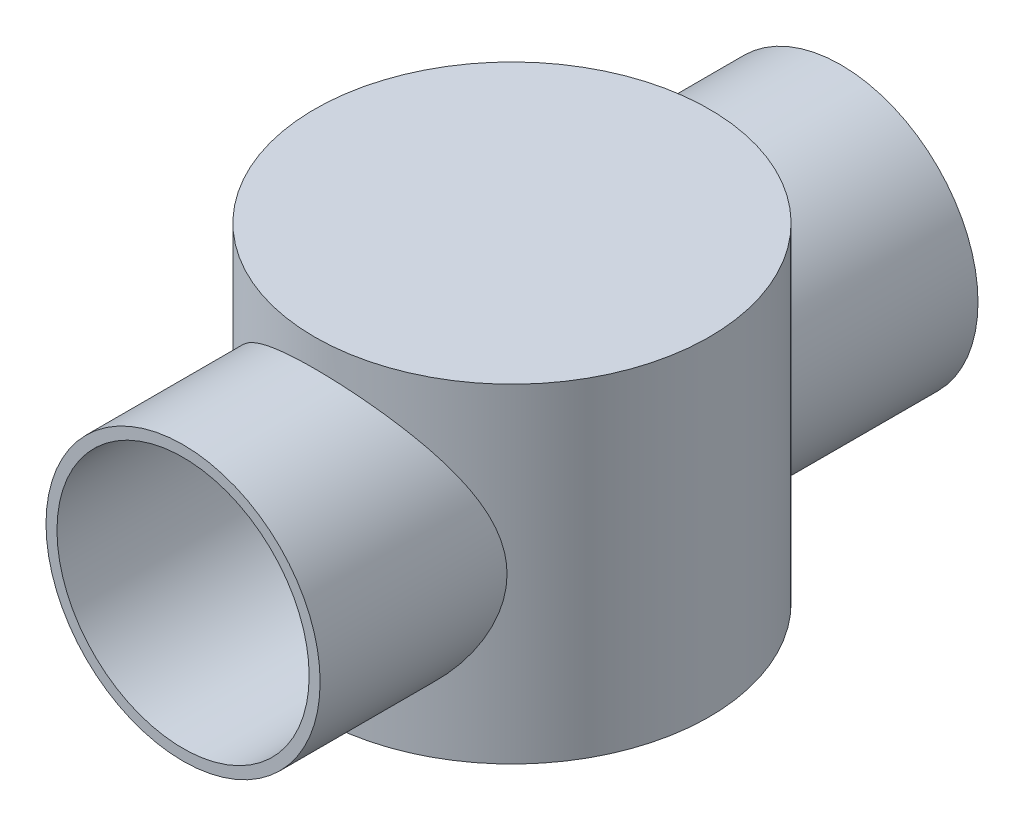
ISO-10303-21;
HEADER;
FILE_DESCRIPTION(('STEP AP214'),'2;1');
FILE_NAME('part.step','',(''),(''),'','','');
FILE_SCHEMA(('AUTOMOTIVE_DESIGN { 1 0 10303 214 1 1 1 1 }'));
ENDSEC;
DATA;
#1=APPLICATION_CONTEXT('core data for automotive mechanical design processes');
#2=APPLICATION_PROTOCOL_DEFINITION('international standard','automotive_design',2000,#1);
#3=PRODUCT_CONTEXT('',#1,'mechanical');
#4=PRODUCT('Part','Part','',(#3));
#5=PRODUCT_RELATED_PRODUCT_CATEGORY('part','',(#4));
#6=PRODUCT_DEFINITION_FORMATION('','',#4);
#7=PRODUCT_DEFINITION_CONTEXT('part definition',#1,'design');
#8=PRODUCT_DEFINITION('design','',#6,#7);
#9=PRODUCT_DEFINITION_SHAPE('','',#8);
#10=(LENGTH_UNIT() NAMED_UNIT(*) SI_UNIT(.MILLI.,.METRE.));
#11=(NAMED_UNIT(*) PLANE_ANGLE_UNIT() SI_UNIT($,.RADIAN.));
#12=(NAMED_UNIT(*) SI_UNIT($,.STERADIAN.) SOLID_ANGLE_UNIT());
#13=UNCERTAINTY_MEASURE_WITH_UNIT(LENGTH_MEASURE(1.E-05),#10,'distance_accuracy_value','');
#14=(GEOMETRIC_REPRESENTATION_CONTEXT(3) GLOBAL_UNCERTAINTY_ASSIGNED_CONTEXT((#13)) GLOBAL_UNIT_ASSIGNED_CONTEXT((#10,
#11,#12)) REPRESENTATION_CONTEXT('',''));
#15=CARTESIAN_POINT('',(0.,0.,0.));
#16=DIRECTION('',(0.,0.,1.));
#17=DIRECTION('',(1.,0.,0.));
#18=AXIS2_PLACEMENT_3D('',#15,#16,#17);
#19=CARTESIAN_POINT('',(0.,30.,0.));
#20=DIRECTION('',(0.,-1.,0.));
#21=DIRECTION('',(0.,0.,-1.));
#22=AXIS2_PLACEMENT_3D('',#19,#20,#21);
#23=CYLINDRICAL_SURFACE('',#22,18.);
#24=CARTESIAN_POINT('',(0.,27.5,-18.));
#25=CARTESIAN_POINT('',(-0.311320399920425,27.5000007881177,-18.000000731677));
#26=CARTESIAN_POINT('',(-0.622631306435012,27.4883541807867,-17.9919068310897));
#27=CARTESIAN_POINT('',(-1.24267850062256,27.4419610864565,-17.9597359592503));
#28=CARTESIAN_POINT('',(-1.55141489222856,27.4072155365763,-17.9356596364017));
#29=CARTESIAN_POINT('',(-2.16398026841423,27.3151597306378,-17.872102635107));
#30=CARTESIAN_POINT('',(-2.46780765796138,27.2578422881339,-17.832617050692));
#31=CARTESIAN_POINT('',(-3.06826221688685,27.1214917950907,-17.7391685432545));
#32=CARTESIAN_POINT('',(-3.3648892162219,27.042458232249,-17.6852052786915));
#33=CARTESIAN_POINT('',(-3.94759562422336,26.8641845184547,-17.5642992210941));
#34=CARTESIAN_POINT('',(-4.23371994775082,26.7650462505048,-17.4974219499454));
#35=CARTESIAN_POINT('',(-4.79541984254895,26.5474961815674,-17.351891309388));
#36=CARTESIAN_POINT('',(-5.07099549402368,26.4290845271559,-17.2732380295375));
#37=CARTESIAN_POINT('',(-5.61033962013419,26.1742134665027,-17.1056665513965));
#38=CARTESIAN_POINT('',(-5.87411006845259,26.037757092313,-17.0167500779476));
#39=CARTESIAN_POINT('',(-6.38905217616275,25.7478999274759,-16.8301826011411));
#40=CARTESIAN_POINT('',(-6.64021910860794,25.5944928475245,-16.7325283583395));
#41=CARTESIAN_POINT('',(-7.15057236632087,25.2577187619915,-16.5212624964768));
#42=CARTESIAN_POINT('',(-7.40853486712312,25.0729045679924,-16.407002352266));
#43=CARTESIAN_POINT('',(-7.90793178514215,24.6857859071178,-16.17222184494));
#44=CARTESIAN_POINT('',(-8.14936566458043,24.4834808716408,-16.0517012783586));
#45=CARTESIAN_POINT('',(-8.61553858934382,24.0620842476447,-15.8063900878489));
#46=CARTESIAN_POINT('',(-8.84025167771147,23.8429675896295,-15.6815932467326));
#47=CARTESIAN_POINT('',(-9.27206071755608,23.389099602017,-15.4302074034379));
#48=CARTESIAN_POINT('',(-9.47916034452515,23.1543515526223,-15.3036187816224));
#49=CARTESIAN_POINT('',(-9.90967313478784,22.627792855491,-15.0291157120774));
#50=CARTESIAN_POINT('',(-10.1296948943652,22.3331428695244,-14.8813068083426));
#51=CARTESIAN_POINT('',(-10.5440092675764,21.7238111474815,-14.5906791488182));
#52=CARTESIAN_POINT('',(-10.738295342259,21.4091243503883,-14.4478616680145));
#53=CARTESIAN_POINT('',(-11.0995515347588,20.7608569146594,-14.172208979582));
#54=CARTESIAN_POINT('',(-11.2665573185518,20.427301725525,-14.0393608630349));
#55=CARTESIAN_POINT('',(-11.5717530284827,19.7418467457873,-13.7888906177999));
#56=CARTESIAN_POINT('',(-11.709957929013,19.3899566076102,-13.671260588923));
#57=CARTESIAN_POINT('',(-11.9175777008529,18.7803111433832,-13.4901468569229));
#58=CARTESIAN_POINT('',(-11.9950717632579,18.5269249889904,-13.4211421027558));
#59=CARTESIAN_POINT('',(-12.134373842049,18.0129415849358,-13.2953294979551));
#60=CARTESIAN_POINT('',(-12.1961864748637,17.7523464826162,-13.238518058513));
#61=CARTESIAN_POINT('',(-12.3032187525588,17.2255188949047,-13.1391077531212));
#62=CARTESIAN_POINT('',(-12.3484644980007,16.9592959820817,-13.0964865406526));
#63=CARTESIAN_POINT('',(-12.4217580013532,16.4224309928378,-13.0269909720634));
#64=CARTESIAN_POINT('',(-12.4498057740043,16.1517889202049,-13.0001166024461));
#65=CARTESIAN_POINT('',(-12.4882797677908,15.6065886416308,-12.9631630375502));
#66=CARTESIAN_POINT('',(-12.4986079433365,15.3320170693527,-12.9531772942498));
#67=CARTESIAN_POINT('',(-12.5011287971122,14.7827126489487,-12.9507444739345));
#68=CARTESIAN_POINT('',(-12.4933215177135,14.507979801201,-12.9582973559426));
#69=CARTESIAN_POINT('',(-12.459722240521,13.9604826584172,-12.9906064202795));
#70=CARTESIAN_POINT('',(-12.4339193210035,13.6877196605265,-13.0153730497628));
#71=CARTESIAN_POINT('',(-12.3648157292816,13.1464092260284,-13.0810393461224));
#72=CARTESIAN_POINT('',(-12.3215146821552,12.8778618798755,-13.1219393586786));
#73=CARTESIAN_POINT('',(-12.2213830333495,12.3633087709337,-13.2152243963537));
#74=CARTESIAN_POINT('',(-12.1655678897363,12.1169435895205,-13.2667312149682));
#75=CARTESIAN_POINT('',(-12.0398975180506,11.6304214111863,-13.3808848961772));
#76=CARTESIAN_POINT('',(-11.9700371133261,11.3902667402102,-13.4435358651791));
#77=CARTESIAN_POINT('',(-11.7403809760295,10.6801807288625,-13.6456942318489));
#78=CARTESIAN_POINT('',(-11.560503590979,10.2205935242823,-13.7994136375129));
#79=CARTESIAN_POINT('',(-11.2015564207548,9.4400543955594,-14.0913121414945));
#80=CARTESIAN_POINT('',(-11.0326655226633,9.11231351521577,-14.2243586578052));
#81=CARTESIAN_POINT('',(-10.6684902470393,8.4756021232813,-14.4994962063504));
#82=CARTESIAN_POINT('',(-10.4731953769698,8.16663914485582,-14.6415908222261));
#83=CARTESIAN_POINT('',(-10.0571360107904,7.56782568543127,-14.93044822444));
#84=CARTESIAN_POINT('',(-9.83632737157997,7.27800973549363,-15.0772187734031));
#85=CARTESIAN_POINT('',(-9.37043152105822,6.71885267060023,-15.3711048725789));
#86=CARTESIAN_POINT('',(-9.12534734432854,6.44950900391229,-15.5182203774311));
#87=CARTESIAN_POINT('',(-8.60878316596403,5.92946290388744,-15.810690004262));
#88=CARTESIAN_POINT('',(-8.33704228658089,5.67899832394039,-15.9560069074782));
#89=CARTESIAN_POINT('',(-7.77021056973397,5.201472251432,-16.2395891488841));
#90=CARTESIAN_POINT('',(-7.47511759556365,4.97441290482628,-16.3778538398915));
#91=CARTESIAN_POINT('',(-6.86313112879639,4.54597225366917,-16.6435728993947));
#92=CARTESIAN_POINT('',(-6.5462778241747,4.3445454741652,-16.7710462744071));
#93=CARTESIAN_POINT('',(-5.89171270058505,3.96913644818394,-17.0120322082357));
#94=CARTESIAN_POINT('',(-5.55400717646866,3.79514597507712,-17.1255489496161));
#95=CARTESIAN_POINT('',(-4.93667435087042,3.5122838774699,-17.3121052009347));
#96=CARTESIAN_POINT('',(-4.66075600112096,3.39752540461204,-17.3885405284797));
#97=CARTESIAN_POINT('',(-4.09874523522462,3.18728426716007,-17.5295226782729));
#98=CARTESIAN_POINT('',(-3.81265487051392,3.09179774154977,-17.5940718816054));
#99=CARTESIAN_POINT('',(-3.23196491189394,2.92126139127021,-17.7099410942229));
#100=CARTESIAN_POINT('',(-2.93736940056444,2.84620193598668,-17.7612673370375));
#101=CARTESIAN_POINT('',(-2.34140857486937,2.71746235086375,-17.849608853893));
#102=CARTESIAN_POINT('',(-2.04004311844967,2.66378267008075,-17.8866238273423));
#103=CARTESIAN_POINT('',(-1.4315283198651,2.5784267757545,-17.9455990048085));
#104=CARTESIAN_POINT('',(-1.12436097402841,2.54683739015424,-17.9674997967678));
#105=CARTESIAN_POINT('',(-0.507806023379982,2.50649888716343,-17.9954815992818));
#106=CARTESIAN_POINT('',(-0.198418419359331,2.49774976163511,-18.0015626154731));
#107=CARTESIAN_POINT('',(0.420050756882506,2.50323267552499,-17.9977551434437));
#108=CARTESIAN_POINT('',(0.729132330636854,2.51746459922299,-17.9878667356366));
#109=CARTESIAN_POINT('',(1.34447957565647,2.56868114932978,-17.9523632811902));
#110=CARTESIAN_POINT('',(1.65074533809179,2.60566503642604,-17.9267487455629));
#111=CARTESIAN_POINT('',(2.23927541240118,2.69882731708707,-17.8624687967111));
#112=CARTESIAN_POINT('',(2.52185162333256,2.75367535091744,-17.8247097270596));
#113=CARTESIAN_POINT('',(3.0806783153945,2.88217766451085,-17.7366690185098));
#114=CARTESIAN_POINT('',(3.35692911270888,2.95583100202091,-17.6863880070353));
#115=CARTESIAN_POINT('',(3.90156410766982,3.12107814043559,-17.5742738724126));
#116=CARTESIAN_POINT('',(4.16994889761655,3.2126705865379,-17.5124416216564));
#117=CARTESIAN_POINT('',(4.69769215509028,3.41287878505748,-17.3783156384069));
#118=CARTESIAN_POINT('',(4.95704725604193,3.52150080535138,-17.3060180548151));
#119=CARTESIAN_POINT('',(5.48423252849856,3.76330392165646,-17.1465588362983));
#120=CARTESIAN_POINT('',(5.75129246214408,3.89770099080385,-17.0586964063433));
#121=CARTESIAN_POINT('',(6.27282216592668,4.18379843456298,-16.87389364273));
#122=CARTESIAN_POINT('',(6.52728660120513,4.33550605269518,-16.776949511935));
#123=CARTESIAN_POINT('',(7.0228417481772,4.65511457222595,-16.5756219290891));
#124=CARTESIAN_POINT('',(7.26392848537503,4.8230202458981,-16.4712362869982));
#125=CARTESIAN_POINT('',(7.7321050957996,5.17400555434002,-16.2567177712083));
#126=CARTESIAN_POINT('',(7.959193347751,5.35708694099328,-16.1465842345178));
#127=CARTESIAN_POINT('',(8.43636798345726,5.76996890826061,-15.9031790708217));
#128=CARTESIAN_POINT('',(8.68378752169934,6.00241677450386,-15.769160440539));
#129=CARTESIAN_POINT('',(9.15825747915977,6.48583202251305,-15.4984174988106));
#130=CARTESIAN_POINT('',(9.38530489429072,6.7368021256689,-15.3616927919413));
#131=CARTESIAN_POINT('',(9.81855806068082,7.25658525117956,-15.0884574150436));
#132=CARTESIAN_POINT('',(10.0247492483396,7.52541052748361,-14.95194695922));
#133=CARTESIAN_POINT('',(10.4153760936451,8.08010177730584,-14.6825139944411));
#134=CARTESIAN_POINT('',(10.5998145028604,8.36596558867169,-14.5495910333378));
#135=CARTESIAN_POINT('',(10.9270965024338,8.9220914466448,-14.305090664831));
#136=CARTESIAN_POINT('',(11.0722829221891,9.19064706505239,-14.1927675977497));
#137=CARTESIAN_POINT('',(11.3437968982352,9.74050631550314,-13.9767081782071));
#138=CARTESIAN_POINT('',(11.4701242259695,10.0218101019897,-13.8729719298177));
#139=CARTESIAN_POINT('',(11.7026245208659,10.596094408124,-13.6774131044558));
#140=CARTESIAN_POINT('',(11.8088296103176,10.8890553982851,-13.5855716146506));
#141=CARTESIAN_POINT('',(12.0000146690085,11.4860554800293,-13.4170011159792));
#142=CARTESIAN_POINT('',(12.0849999433626,11.7900917808755,-13.3402683308386));
#143=CARTESIAN_POINT('',(12.2182478508252,12.3485238407824,-13.2182051251944));
#144=CARTESIAN_POINT('',(12.2704254511073,12.6012890898089,-13.1696755115163));
#145=CARTESIAN_POINT('',(12.3592702105864,13.1117432606945,-13.0863350699331));
#146=CARTESIAN_POINT('',(12.3959407456396,13.3694310981363,-13.0515212562395));
#147=CARTESIAN_POINT('',(12.4531630584138,13.8879350928535,-12.9969343623921));
#148=CARTESIAN_POINT('',(12.4737302454128,14.1487480164394,-12.9771469040807));
#149=CARTESIAN_POINT('',(12.4984360228864,14.6718827163967,-12.9533546705078));
#150=CARTESIAN_POINT('',(12.5025744011595,14.9342045122137,-12.9493500991048));
#151=CARTESIAN_POINT('',(12.4943408363494,15.458515031979,-12.9572943884832));
#152=CARTESIAN_POINT('',(12.4819580945241,15.720503425931,-12.9692536837703));
#153=CARTESIAN_POINT('',(12.440893901037,16.2420073147799,-13.0086493963747));
#154=CARTESIAN_POINT('',(12.412212546458,16.501522824397,-13.0360857215028));
#155=CARTESIAN_POINT('',(12.3389986266428,17.0166507896635,-13.1054051586568));
#156=CARTESIAN_POINT('',(12.2944472319189,17.272258231127,-13.1473054300332));
#157=CARTESIAN_POINT('',(12.1901619031325,17.7778819175319,-13.2440551928841));
#158=CARTESIAN_POINT('',(12.1304243539571,18.0278968157102,-13.2989077674745));
#159=CARTESIAN_POINT('',(11.9768092653866,18.5938043870992,-13.4376213550251));
#160=CARTESIAN_POINT('',(11.8780580771438,18.9074520883862,-13.5252695016876));
#161=CARTESIAN_POINT('',(11.6579478787732,19.5220451500959,-13.7154431106477));
#162=CARTESIAN_POINT('',(11.5365818571558,19.82298653547,-13.8179731847441));
#163=CARTESIAN_POINT('',(11.2724911751495,20.4115719579404,-14.0342473268634));
#164=CARTESIAN_POINT('',(11.1297415987181,20.6991999636696,-14.1480044231101));
#165=CARTESIAN_POINT('',(10.8241270591563,21.2602168679723,-14.3831653910737));
#166=CARTESIAN_POINT('',(10.6612633353483,21.5336066423525,-14.5045687914421));
#167=CARTESIAN_POINT('',(10.3123343939813,22.0718426624964,-14.7547582990502));
#168=CARTESIAN_POINT('',(10.1258240657712,22.336350957248,-14.8836497126861));
#169=CARTESIAN_POINT('',(9.7333642472688,22.8495846263023,-15.1432155840668));
#170=CARTESIAN_POINT('',(9.52741480464069,23.0983100393017,-15.2738900374389));
#171=CARTESIAN_POINT('',(9.09656663348192,23.5794390712763,-15.5343445013484));
#172=CARTESIAN_POINT('',(8.87166225858612,23.8118377887255,-15.6641242328196));
#173=CARTESIAN_POINT('',(8.40345080276108,24.2594230615636,-15.9202147459001));
#174=CARTESIAN_POINT('',(8.16014192681605,24.4746079338408,-16.046525187503));
#175=CARTESIAN_POINT('',(7.61332624290886,24.9212854382121,-16.3139431002473));
#176=CARTESIAN_POINT('',(7.3065669432611,25.1494610303998,-16.453979696678));
#177=CARTESIAN_POINT('',(6.66975124855428,25.5788415966015,-16.722254715961));
#178=CARTESIAN_POINT('',(6.33969127170836,25.780042410203,-16.8504913179052));
#179=CARTESIAN_POINT('',(5.65828495469929,26.1527769868363,-17.0913496260948));
#180=CARTESIAN_POINT('',(5.3069628140265,26.3243436512688,-17.2039886217031));
#181=CARTESIAN_POINT('',(4.58507299306316,26.6353520713999,-17.4102805123675));
#182=CARTESIAN_POINT('',(4.21451184563756,26.7748046455683,-17.503939799954));
#183=CARTESIAN_POINT('',(3.53078207948951,26.9952677136963,-17.6530797369256));
#184=CARTESIAN_POINT('',(3.22041077517135,27.0823667780218,-17.712441759367));
#185=CARTESIAN_POINT('',(2.59137372701929,27.2327141577823,-17.8153383699576));
#186=CARTESIAN_POINT('',(2.27270914343893,27.2959657905689,-17.858875159482));
#187=CARTESIAN_POINT('',(1.62985419119081,27.3975556176929,-17.9289719343013));
#188=CARTESIAN_POINT('',(1.3056686473665,27.435914524093,-17.9555460331483));
#189=CARTESIAN_POINT('',(0.654318536286639,27.4871360564587,-17.9910595123127));
#190=CARTESIAN_POINT('',(0.327154026331433,27.499999171799,-17.9999992311102));
#191=CARTESIAN_POINT('',(0.,27.5,-18.));
#192=B_SPLINE_CURVE_WITH_KNOTS('',3,(#24,#25,#26,#27,#28,#29,#30,#31,#32,#33,#34,#35,#36,#37,
#38,#39,#40,#41,#42,#43,#44,#45,#46,#47,#48,#49,#50,#51,#52,#53,#54,#55,#56,#57,#58,#59,#60,#61,
#62,#63,#64,#65,#66,#67,#68,#69,#70,#71,#72,#73,#74,#75,#76,#77,#78,#79,#80,#81,#82,#83,#84,#85,
#86,#87,#88,#89,#90,#91,#92,#93,#94,#95,#96,#97,#98,#99,#100,#101,#102,#103,#104,#105,#106,#107,
#108,#109,#110,#111,#112,#113,#114,#115,#116,#117,#118,#119,#120,#121,#122,#123,#124,#125,#126,
#127,#128,#129,#130,#131,#132,#133,#134,#135,#136,#137,#138,#139,#140,#141,#142,#143,#144,#145,
#146,#147,#148,#149,#150,#151,#152,#153,#154,#155,#156,#157,#158,#159,#160,#161,#162,#163,#164,
#165,#166,#167,#168,#169,#170,#171,#172,#173,#174,#175,#176,#177,#178,#179,#180,#181,#182,#183,
#184,#185,#186,#187,#188,#189,#190,#191),.UNSPECIFIED.,.T.,.F.,(4,2,2,2,2,2,2,2,2,2,2,2,2,2,2,2,
2,2,2,2,2,2,2,2,2,2,2,2,2,2,2,2,2,2,2,2,2,2,2,2,2,2,2,2,2,2,2,2,2,2,2,2,2,2,2,2,2,2,2,2,2,2,2,2,
2,2,2,2,2,2,2,2,2,2,2,2,2,2,2,2,2,2,2,4),(0.,0.933624947814568,1.86721202097863,
2.80109657048012,3.73500315303643,4.66429028538479,5.59357035073977,6.52269446721874,
7.45216448621777,8.46302839743877,9.47392518271222,10.4863598651547,11.4985827565715,
12.6862008655619,13.8741201494284,15.0604737094207,16.2462089032293,17.0669215736163,
17.8873923547393,18.7065648931763,19.5257367294933,20.3494267395149,21.1731148250854,
21.9973032502429,22.8215093357315,23.5941713808879,24.3671187293383,25.9129089294303,
27.0874967653771,28.2625527441588,29.4396730996352,30.6166464935651,31.8065766183639,
32.9966157474236,34.1845132775931,35.3720539429724,36.2964935720594,37.2207478111027,
38.144565540299,39.068402672151,39.9958509246877,40.9232988467833,41.8507420987645,
42.7781552155799,43.6481414893545,44.5180841804054,45.3879611967204,46.2581591334188,
47.192082876349,48.1263988585481,49.0609909546482,49.9956910906679,51.0895258221994,
52.1835215871804,53.2782760749245,54.3728919353043,55.3479449453504,56.3230097712754,
57.2965046824979,58.2697559683629,59.0568195040135,59.8437116092359,60.6298498147753,
61.4159981743777,62.20266063797,62.9893184158477,63.7769126734933,64.564694596348,
65.5841111046669,66.6038441997531,67.6247748619828,68.6456426514725,69.6898367085289,
70.73402820532,71.7785318566167,72.8231375114393,74.0429262395139,75.262902883883,
76.4815162155208,77.6997184229364,78.6818007276419,79.6637463670817,80.6448739247576,
81.6259826501707),.UNSPECIFIED.);
#193=CARTESIAN_POINT('',(0.,27.5,-18.));
#194=VERTEX_POINT('',#193);
#195=EDGE_CURVE('E45',#194,#194,#192,.T.);
#196=ORIENTED_EDGE('',*,*,#195,.T.);
#197=EDGE_LOOP('',(#196));
#198=FACE_BOUND('',#197,.T.);
#199=CARTESIAN_POINT('',(12.5,15.,12.9518338469886));
#200=CARTESIAN_POINT('',(12.4999976797193,14.699104822188,12.9518380580316));
#201=CARTESIAN_POINT('',(12.4891107062001,14.3981777459185,12.9623703478934));
#202=CARTESIAN_POINT('',(12.4458226770992,13.7992970290588,13.0039366124756));
#203=CARTESIAN_POINT('',(12.4134180340691,13.5013438926961,13.0349740058242));
#204=CARTESIAN_POINT('',(12.3277613016309,12.9106141128189,13.116011539855));
#205=CARTESIAN_POINT('',(12.2744759132078,12.6178465221533,13.1660419651719));
#206=CARTESIAN_POINT('',(12.14806377555,12.0399109507838,13.2827681254356));
#207=CARTESIAN_POINT('',(12.074926326434,11.7547471596741,13.349472845971));
#208=CARTESIAN_POINT('',(11.9108858008914,11.1967900768827,13.4960261990246));
#209=CARTESIAN_POINT('',(11.8201921072103,10.9238936275133,13.5757183218099));
#210=CARTESIAN_POINT('',(11.6216207598421,10.388102602949,13.7460936515553));
#211=CARTESIAN_POINT('',(11.5137444903445,10.125207224202,13.8367759730292));
#212=CARTESIAN_POINT('',(11.1656842659496,9.35228372669715,14.121506422653));
#213=CARTESIAN_POINT('',(10.9009711206559,8.85769160180396,14.328329443242));
#214=CARTESIAN_POINT('',(10.4342119359854,8.10916626798092,14.6687789833506));
#215=CARTESIAN_POINT('',(10.2515578840197,7.84033405481909,14.7972818930296));
#216=CARTESIAN_POINT('',(9.86647448321659,7.31834613656705,15.0567760164433));
#217=CARTESIAN_POINT('',(9.6640436757638,7.06519159002117,15.1877674131391));
#218=CARTESIAN_POINT('',(9.23981964746334,6.5749810378033,15.4495293280734));
#219=CARTESIAN_POINT('',(9.01800458555287,6.33794374081089,15.5802994234218));
#220=CARTESIAN_POINT('',(8.55570623570184,5.88103581687445,15.8388776500339));
#221=CARTESIAN_POINT('',(8.31522168943693,5.66116634904986,15.9666855808923));
#222=CARTESIAN_POINT('',(7.77539612252942,5.20522835616953,16.2372595298217));
#223=CARTESIAN_POINT('',(7.47285161548954,4.97236304087319,16.3790670512296));
#224=CARTESIAN_POINT('',(6.84421514626606,4.533208464207,16.6515490396227));
#225=CARTESIAN_POINT('',(6.51811895685266,4.32692399235452,16.7822214987839));
#226=CARTESIAN_POINT('',(5.84445579044713,3.94367780988839,17.0285274719657));
#227=CARTESIAN_POINT('',(5.49692393494182,3.76666979571199,17.1441846705374));
#228=CARTESIAN_POINT('',(4.7821647020107,3.44429036229083,17.3571245354996));
#229=CARTESIAN_POINT('',(4.41494579885826,3.29890546504427,17.4544150275691));
#230=CARTESIAN_POINT('',(3.76371708196102,3.07651952338444,17.6043911081921));
#231=CARTESIAN_POINT('',(3.48352577531744,2.99161277449439,17.662059675042));
#232=CARTESIAN_POINT('',(2.91570147234552,2.84126305538922,17.7646236393564));
#233=CARTESIAN_POINT('',(2.62807004029075,2.77581602938026,17.8095216983643));
#234=CARTESIAN_POINT('',(2.04731540718361,2.66525950394078,17.8855868037861));
#235=CARTESIAN_POINT('',(1.75419572674545,2.62013740255849,17.9167623582151));
#236=CARTESIAN_POINT('',(1.16430646092767,2.55080009036961,17.9647418602541));
#237=CARTESIAN_POINT('',(0.867536752771681,2.5265855847955,17.9815453230799));
#238=CARTESIAN_POINT('',(0.271993540054801,2.49939849824911,18.0004150323214));
#239=CARTESIAN_POINT('',(-0.0267826860795567,2.4964660180024,18.0024534576531));
#240=CARTESIAN_POINT('',(-0.623506228558426,2.51199292652255,17.9916727899375));
#241=CARTESIAN_POINT('',(-0.921453547998446,2.53045223529512,17.9788537524495));
#242=CARTESIAN_POINT('',(-1.51435284920527,2.58849378339618,17.9386468181875));
#243=CARTESIAN_POINT('',(-1.80930410779212,2.62808100459268,17.9112554853359));
#244=CARTESIAN_POINT('',(-2.39404409837468,2.72781495695998,17.8425116428688));
#245=CARTESIAN_POINT('',(-2.6838328226686,2.78796171880018,17.8011591124269));
#246=CARTESIAN_POINT('',(-3.25014030000358,2.92648695052048,17.7064175726975));
#247=CARTESIAN_POINT('',(-3.52681057804168,3.00444069909257,17.6533097389695));
#248=CARTESIAN_POINT('',(-4.07189958108011,3.1783469552641,17.5356033433843));
#249=CARTESIAN_POINT('',(-4.34031848206724,3.27429907868066,17.4710050267978));
#250=CARTESIAN_POINT('',(-4.86763861549374,3.48320694807238,17.3314880748841));
#251=CARTESIAN_POINT('',(-5.12654066287423,3.59616123388916,17.2565703258443));
#252=CARTESIAN_POINT('',(-5.63393974064637,3.8381111796855,17.0976442846672));
#253=CARTESIAN_POINT('',(-5.88243296373269,3.96711264202801,17.0136327058028));
#254=CARTESIAN_POINT('',(-6.3953639721949,4.25545233003509,16.8280064033705));
#255=CARTESIAN_POINT('',(-6.65846946696387,4.41657011439902,16.7254739989572));
#256=CARTESIAN_POINT('',(-7.1700248402112,4.75621823281929,16.5126478677386));
#257=CARTESIAN_POINT('',(-7.41846834630622,4.93475604980778,16.4023508112729));
#258=CARTESIAN_POINT('',(-7.90021497215849,5.30827197885094,16.1758311739301));
#259=CARTESIAN_POINT('',(-8.13350361733577,5.50326541085375,16.0596031120586));
#260=CARTESIAN_POINT('',(-8.58413950856359,5.90855532605528,15.8233140743437));
#261=CARTESIAN_POINT('',(-8.80149125583206,6.11884745460026,15.7032541946162));
#262=CARTESIAN_POINT('',(-9.25686156757815,6.59246449798952,15.4399264815778));
#263=CARTESIAN_POINT('',(-9.49175961410808,6.85859967949683,15.2963016275034));
#264=CARTESIAN_POINT('',(-9.93836824565562,7.41021691416694,15.0099705181362));
#265=CARTESIAN_POINT('',(-10.1500741634077,7.69570284289872,14.8672644531625));
#266=CARTESIAN_POINT('',(-10.5493541665407,8.28525058414792,14.5866600190946));
#267=CARTESIAN_POINT('',(-10.7369324127249,8.58930918044473,14.4487608240565));
#268=CARTESIAN_POINT('',(-11.0867962679823,9.2154103182733,14.1820768600496));
#269=CARTESIAN_POINT('',(-11.2490894407241,9.53744744247986,14.053289371761));
#270=CARTESIAN_POINT('',(-11.5120812251052,10.121552735917,13.8381269853004));
#271=CARTESIAN_POINT('',(-11.618315055378,10.3800748864121,13.7488686847102));
#272=CARTESIAN_POINT('',(-11.8141266329691,10.9066779268415,13.5809808671025));
#273=CARTESIAN_POINT('',(-11.9037086375049,11.1747563526662,13.5023486348242));
#274=CARTESIAN_POINT('',(-12.0651211377789,11.7192462201814,13.3583140370218));
#275=CARTESIAN_POINT('',(-12.1369782367197,11.9956444663706,13.2928918716962));
#276=CARTESIAN_POINT('',(-12.2620739092141,12.5558461612631,13.1775870507921));
#277=CARTESIAN_POINT('',(-12.3153126932096,12.8396495262279,13.1277042195739));
#278=CARTESIAN_POINT('',(-12.4026381412253,13.4156322994948,13.045238057055));
#279=CARTESIAN_POINT('',(-12.4365309212633,13.7078666861925,13.0128300291544));
#280=CARTESIAN_POINT('',(-12.4836126280017,14.2955248179675,12.9676712278828));
#281=CARTESIAN_POINT('',(-12.4968022008865,14.5909484632126,12.9549198409929));
#282=CARTESIAN_POINT('',(-12.5021676878648,15.182105499988,12.9497419885133));
#283=CARTESIAN_POINT('',(-12.4943478410788,15.4778388169992,12.9573114227432));
#284=CARTESIAN_POINT('',(-12.4578878173898,16.0668086006473,12.9923694186606));
#285=CARTESIAN_POINT('',(-12.4292483882957,16.3600451565815,13.0198572649078));
#286=CARTESIAN_POINT('',(-12.3569279832965,16.9029217891393,13.088484769269));
#287=CARTESIAN_POINT('',(-12.3157401532355,17.1531942710192,13.1273354396596));
#288=CARTESIAN_POINT('',(-12.2187698677807,17.6486614157574,13.2176416537223));
#289=CARTESIAN_POINT('',(-12.1629821585536,17.8938542163221,13.2691017345228));
#290=CARTESIAN_POINT('',(-12.0374713886653,18.3781508970087,13.3830660590144));
#291=CARTESIAN_POINT('',(-11.9677405977213,18.6172513161343,13.445576426935));
#292=CARTESIAN_POINT('',(-11.8150493045519,19.0885195392081,13.5799467773926));
#293=CARTESIAN_POINT('',(-11.7320857481663,19.3206857279934,13.6518089176388));
#294=CARTESIAN_POINT('',(-11.5118891942741,19.8842443506223,13.8385638069959));
#295=CARTESIAN_POINT('',(-11.3674026564686,20.2113585109792,13.9578827768067));
#296=CARTESIAN_POINT('',(-11.053077224143,20.8485728627441,14.2080910557213));
#297=CARTESIAN_POINT('',(-10.8832283320815,21.1586662785561,14.3389849191767));
#298=CARTESIAN_POINT('',(-10.5192370165857,21.7616463061753,14.6081129860002));
#299=CARTESIAN_POINT('',(-10.3250553502878,22.0545039735748,14.7463588342131));
#300=CARTESIAN_POINT('',(-9.91363888577974,22.6218462410074,15.0260319940461));
#301=CARTESIAN_POINT('',(-9.69640671788945,22.8963329315576,15.167458941219));
#302=CARTESIAN_POINT('',(-9.23560919213577,23.4309084460669,15.4524495483785));
#303=CARTESIAN_POINT('',(-8.99164854497931,23.6906599808276,15.5960071402852));
#304=CARTESIAN_POINT('',(-8.48127342350149,24.1894126667389,15.879332379517));
#305=CARTESIAN_POINT('',(-8.21485729446084,24.4284122860651,16.0190997465399));
#306=CARTESIAN_POINT('',(-7.66066950562706,24.8839580775869,16.2913884728026));
#307=CARTESIAN_POINT('',(-7.37292648810238,25.1005334607845,16.4239191497394));
#308=CARTESIAN_POINT('',(-6.77671439553398,25.5098440924593,16.6787644708413));
#309=CARTESIAN_POINT('',(-6.46824941143075,25.7025840253221,16.8010811208318));
#310=CARTESIAN_POINT('',(-5.88456902111879,26.0324460534321,17.013279804711));
#311=CARTESIAN_POINT('',(-5.61230059153505,26.1734936050122,17.1051793846704));
#312=CARTESIAN_POINT('',(-5.05527466805322,26.4363015752517,17.2779972878766));
#313=CARTESIAN_POINT('',(-4.77051945719444,26.5580655010421,17.3589176075471));
#314=CARTESIAN_POINT('',(-4.18994515209828,26.7809592004237,17.5081165942596));
#315=CARTESIAN_POINT('',(-3.89413042416615,26.8820970175172,17.5764001882427));
#316=CARTESIAN_POINT('',(-3.29303397490103,27.0625196614092,17.6988697313596));
#317=CARTESIAN_POINT('',(-2.98775216190538,27.141804276546,17.7530555439474));
#318=CARTESIAN_POINT('',(-2.36807618457245,27.2777597182791,17.8463139109516));
#319=CARTESIAN_POINT('',(-2.05364064221718,27.3343017410186,17.8853003457161));
#320=CARTESIAN_POINT('',(-1.41975862390444,27.4232324160442,17.9467453332316));
#321=CARTESIAN_POINT('',(-1.10031213173161,27.4556209901538,17.9692038324872));
#322=CARTESIAN_POINT('',(-0.459212733679359,27.4956892403478,17.9970008913885));
#323=CARTESIAN_POINT('',(-0.137560443508468,27.5033755511033,18.0023440479667));
#324=CARTESIAN_POINT('',(0.505187733505546,27.4939213063141,17.995778822236));
#325=CARTESIAN_POINT('',(0.826283657406093,27.4767824733398,17.9838716368962));
#326=CARTESIAN_POINT('',(1.43552060345606,27.4207096973383,17.9450179954247));
#327=CARTESIAN_POINT('',(1.72396048173365,27.3839404222113,17.9195659174349));
#328=CARTESIAN_POINT('',(2.29610177310975,27.290724711655,17.8552729986054));
#329=CARTESIAN_POINT('',(2.57980353202883,27.2342797189303,17.8164331394153));
#330=CARTESIAN_POINT('',(3.14073699360243,27.1024295103012,17.7261528119345));
#331=CARTESIAN_POINT('',(3.41796793850804,27.0270220859002,17.6747108759363));
#332=CARTESIAN_POINT('',(3.96440358515446,26.8581321042635,17.5602233610979));
#333=CARTESIAN_POINT('',(4.23360788435481,26.764648642259,17.4971772014334));
#334=CARTESIAN_POINT('',(4.77308801036918,26.5565767365977,17.3579450074004));
#335=CARTESIAN_POINT('',(5.04299133500613,26.4413040537439,17.2813404274558));
#336=CARTESIAN_POINT('',(5.57158601094567,26.193420326449,17.1182343921155));
#337=CARTESIAN_POINT('',(5.83027720559476,26.0608090398607,17.0317327985021));
#338=CARTESIAN_POINT('',(6.33556764928932,25.7793424929737,16.8503010694941));
#339=CARTESIAN_POINT('',(6.58216667224826,25.6304869291247,16.7553707766019));
#340=CARTESIAN_POINT('',(7.06262142627455,25.3175382224599,16.5585866249349));
#341=CARTESIAN_POINT('',(7.29647541545699,25.1534430050614,16.4567318240301));
#342=CARTESIAN_POINT('',(7.78658060663356,24.7840446918156,16.2312316629382));
#343=CARTESIAN_POINT('',(8.04058719703336,24.5763160767671,16.1066751465176));
#344=CARTESIAN_POINT('',(8.53021901487226,24.1428821296805,15.8528051604475));
#345=CARTESIAN_POINT('',(8.76584257283077,23.9171751686668,15.7234912603154));
#346=CARTESIAN_POINT('',(9.21864726799832,23.4482538679163,15.4623729318477));
#347=CARTESIAN_POINT('',(9.43578911567696,23.2050041662048,15.3305638917389));
#348=CARTESIAN_POINT('',(9.85053978233919,22.7021488675502,15.0674215290148));
#349=CARTESIAN_POINT('',(10.0481481551035,22.442542897189,14.9360882173328));
#350=CARTESIAN_POINT('',(10.4515303498019,21.8670908852521,14.6572278369886));
#351=CARTESIAN_POINT('',(10.6540316859944,21.5486717826398,14.5102499507697));
#352=CARTESIAN_POINT('',(11.0310494478733,20.8914751709129,14.2257423986044));
#353=CARTESIAN_POINT('',(11.2055578228074,20.5526918434382,14.0882154572187));
#354=CARTESIAN_POINT('',(11.5242653497991,19.8566856453799,13.8287173764477));
#355=CARTESIAN_POINT('',(11.6685496473968,19.4995182055418,13.706702928531));
#356=CARTESIAN_POINT('',(11.9250249839554,18.7674786182433,13.4841638474088));
#357=CARTESIAN_POINT('',(12.0372402962227,18.3926201130637,13.3836229752998));
#358=CARTESIAN_POINT('',(12.1922400702263,17.7679790930882,13.2422011637376));
#359=CARTESIAN_POINT('',(12.2454054288292,17.5226201478037,13.1929515139249));
#360=CARTESIAN_POINT('',(12.3371255387151,17.0270140417133,13.1072228438953));
#361=CARTESIAN_POINT('',(12.375684562087,16.7767683327498,13.0707400898307));
#362=CARTESIAN_POINT('',(12.4375921367897,16.2730348676933,13.0118460442026));
#363=CARTESIAN_POINT('',(12.4609577707069,16.0195510805538,12.9894189502813));
#364=CARTESIAN_POINT('',(12.4921637256113,15.5107193509908,12.9594100715188));
#365=CARTESIAN_POINT('',(12.5000019692332,15.2553711637207,12.9518302730564));
#366=CARTESIAN_POINT('',(12.5,15.,12.9518338469886));
#367=B_SPLINE_CURVE_WITH_KNOTS('',3,(#199,#200,#201,#202,#203,#204,#205,#206,#207,#208,#209,
#210,#211,#212,#213,#214,#215,#216,#217,#218,#219,#220,#221,#222,#223,#224,#225,#226,#227,#228,
#229,#230,#231,#232,#233,#234,#235,#236,#237,#238,#239,#240,#241,#242,#243,#244,#245,#246,#247,
#248,#249,#250,#251,#252,#253,#254,#255,#256,#257,#258,#259,#260,#261,#262,#263,#264,#265,#266,
#267,#268,#269,#270,#271,#272,#273,#274,#275,#276,#277,#278,#279,#280,#281,#282,#283,#284,#285,
#286,#287,#288,#289,#290,#291,#292,#293,#294,#295,#296,#297,#298,#299,#300,#301,#302,#303,#304,
#305,#306,#307,#308,#309,#310,#311,#312,#313,#314,#315,#316,#317,#318,#319,#320,#321,#322,#323,
#324,#325,#326,#327,#328,#329,#330,#331,#332,#333,#334,#335,#336,#337,#338,#339,#340,#341,#342,
#343,#344,#345,#346,#347,#348,#349,#350,#351,#352,#353,#354,#355,#356,#357,#358,#359,#360,#361,
#362,#363,#364,#365,#366),.UNSPECIFIED.,.T.,.F.,(4,2,2,2,2,2,2,2,2,2,2,2,2,2,2,2,2,2,2,2,2,2,2,
2,2,2,2,2,2,2,2,2,2,2,2,2,2,2,2,2,2,2,2,2,2,2,2,2,2,2,2,2,2,2,2,2,2,2,2,2,2,2,2,2,2,2,2,2,2,2,2,
2,2,2,2,2,2,2,2,2,2,2,2,4),(0.,0.902368220666294,1.8048869228925,2.70885078871024,
3.61330284456312,4.50756756205989,5.40176027601339,7.18909636323283,8.23687063183827,
9.28472223644103,10.3337701100016,11.3828887509388,12.6030504907993,13.8234317811825,
15.0418640705827,16.259776033304,17.1540583611935,18.0481541719736,18.9416948557707,
19.8352656783413,20.7305197785451,21.6257705309695,22.5212324728739,23.4166957505768,
24.2926943646762,25.1686742823441,26.0445790130809,26.9208013804488,27.895182326723,
28.8699836854239,29.8457027996429,30.821145261621,31.9687048522141,33.1164949591316,
34.2640868641616,35.4113348216055,36.2908199287593,37.170079875943,38.0480120057966,
38.9259342121099,39.8125070047486,40.6990521253016,41.5854183789767,42.4717527972464,
43.2407521018379,44.0100285157728,44.7797326181975,45.5496146282869,46.6789270269737,
47.8086857682306,48.9402905696422,50.0717663808819,51.2231026082122,52.3745237505158,
53.5244256033876,54.6741011054715,55.63349114081,56.592706490111,57.5515470587509,
58.5103969140219,59.4746032834222,60.43881277362,61.4027632694266,62.3666468817107,
63.2412949711446,64.1158789412684,64.9905648187424,65.865294488637,66.7743500411138,
67.6834182906304,68.5925035304612,69.5017127064993,70.5536090377924,71.6056007875789,
72.6597757994689,73.7139748871861,74.9273539452897,76.1410813469463,77.3513421022251,
78.5606843591016,79.3275139878721,80.0941191593595,80.8598609061878,81.6257050924979),.UNSPECIFIED.);
#368=CARTESIAN_POINT('',(12.5,15.,12.9518338469886));
#369=VERTEX_POINT('',#368);
#370=EDGE_CURVE('E64',#369,#369,#367,.T.);
#371=ORIENTED_EDGE('',*,*,#370,.T.);
#372=EDGE_LOOP('',(#371));
#373=FACE_BOUND('',#372,.T.);
#374=CARTESIAN_POINT('',(0.,30.,0.));
#375=DIRECTION('',(0.,1.,0.));
#376=DIRECTION('',(0.,0.,1.));
#377=AXIS2_PLACEMENT_3D('',#374,#375,#376);
#378=CIRCLE('',#377,18.);
#379=CARTESIAN_POINT('',(0.,30.,18.));
#380=VERTEX_POINT('',#379);
#381=EDGE_CURVE('E10',#380,#380,#378,.T.);
#382=ORIENTED_EDGE('',*,*,#381,.F.);
#383=EDGE_LOOP('',(#382));
#384=FACE_BOUND('',#383,.T.);
#385=CARTESIAN_POINT('',(0.,0.,0.));
#386=DIRECTION('',(0.,1.,0.));
#387=DIRECTION('',(0.,0.,1.));
#388=AXIS2_PLACEMENT_3D('',#385,#386,#387);
#389=CIRCLE('',#388,18.);
#390=CARTESIAN_POINT('',(0.,0.,18.));
#391=VERTEX_POINT('',#390);
#392=EDGE_CURVE('E54',#391,#391,#389,.T.);
#393=ORIENTED_EDGE('',*,*,#392,.T.);
#394=EDGE_LOOP('',(#393));
#395=FACE_BOUND('',#394,.T.);
#396=ADVANCED_FACE('F41',(#198,#373,#384,#395),#23,.T.);
#397=CARTESIAN_POINT('',(0.,30.,0.));
#398=DIRECTION('',(0.,1.,0.));
#399=DIRECTION('',(0.,0.,1.));
#400=AXIS2_PLACEMENT_3D('',#397,#398,#399);
#401=PLANE('',#400);
#402=ORIENTED_EDGE('',*,*,#381,.T.);
#403=EDGE_LOOP('',(#402));
#404=FACE_BOUND('',#403,.T.);
#405=ADVANCED_FACE('F79',(#404),#401,.T.);
#406=CARTESIAN_POINT('',(0.,0.,0.));
#407=DIRECTION('',(0.,1.,0.));
#408=DIRECTION('',(0.,0.,1.));
#409=AXIS2_PLACEMENT_3D('',#406,#407,#408);
#410=PLANE('',#409);
#411=ORIENTED_EDGE('',*,*,#392,.F.);
#412=EDGE_LOOP('',(#411));
#413=FACE_BOUND('',#412,.T.);
#414=ADVANCED_FACE('F82',(#413),#410,.F.);
#415=CARTESIAN_POINT('',(0.,15.,30.));
#416=DIRECTION('',(0.,0.,1.));
#417=DIRECTION('',(1.,0.,0.));
#418=AXIS2_PLACEMENT_3D('',#415,#416,#417);
#419=PLANE('',#418);
#420=CARTESIAN_POINT('',(0.,15.,30.));
#421=DIRECTION('',(0.,0.,1.));
#422=DIRECTION('',(1.,0.,0.));
#423=AXIS2_PLACEMENT_3D('',#420,#421,#422);
#424=CIRCLE('',#423,11.5);
#425=CARTESIAN_POINT('',(11.5,15.,30.));
#426=VERTEX_POINT('',#425);
#427=EDGE_CURVE('E116',#426,#426,#424,.T.);
#428=ORIENTED_EDGE('',*,*,#427,.F.);
#429=EDGE_LOOP('',(#428));
#430=FACE_BOUND('',#429,.T.);
#431=CARTESIAN_POINT('',(0.,15.,30.));
#432=DIRECTION('',(0.,0.,1.));
#433=DIRECTION('',(1.,0.,0.));
#434=AXIS2_PLACEMENT_3D('',#431,#432,#433);
#435=CIRCLE('',#434,12.5);
#436=CARTESIAN_POINT('',(12.5,15.,30.));
#437=VERTEX_POINT('',#436);
#438=EDGE_CURVE('E108',#437,#437,#435,.T.);
#439=ORIENTED_EDGE('',*,*,#438,.T.);
#440=EDGE_LOOP('',(#439));
#441=FACE_BOUND('',#440,.T.);
#442=ADVANCED_FACE('F84',(#430,#441),#419,.T.);
#443=CARTESIAN_POINT('',(0.,15.,-30.));
#444=DIRECTION('',(0.,0.,1.));
#445=DIRECTION('',(1.,0.,0.));
#446=AXIS2_PLACEMENT_3D('',#443,#444,#445);
#447=CYLINDRICAL_SURFACE('',#446,12.5);
#448=ORIENTED_EDGE('',*,*,#438,.F.);
#449=EDGE_LOOP('',(#448));
#450=FACE_BOUND('',#449,.T.);
#451=ORIENTED_EDGE('',*,*,#370,.F.);
#452=EDGE_LOOP('',(#451));
#453=FACE_BOUND('',#452,.T.);
#454=ADVANCED_FACE('F76',(#450,#453),#447,.T.);
#455=CARTESIAN_POINT('',(0.,15.,-30.));
#456=DIRECTION('',(0.,0.,1.));
#457=DIRECTION('',(1.,0.,0.));
#458=AXIS2_PLACEMENT_3D('',#455,#456,#457);
#459=CIRCLE('',#458,12.5);
#460=CARTESIAN_POINT('',(12.5,15.,-30.));
#461=VERTEX_POINT('',#460);
#462=EDGE_CURVE('E62',#461,#461,#459,.T.);
#463=ORIENTED_EDGE('',*,*,#462,.T.);
#464=EDGE_LOOP('',(#463));
#465=FACE_BOUND('',#464,.T.);
#466=ORIENTED_EDGE('',*,*,#195,.F.);
#467=EDGE_LOOP('',(#466));
#468=FACE_BOUND('',#467,.T.);
#469=ADVANCED_FACE('F70',(#465,#468),#447,.T.);
#470=CARTESIAN_POINT('',(0.,15.,-30.));
#471=DIRECTION('',(0.,0.,1.));
#472=DIRECTION('',(1.,0.,0.));
#473=AXIS2_PLACEMENT_3D('',#470,#471,#472);
#474=PLANE('',#473);
#475=CARTESIAN_POINT('',(0.,15.,-30.));
#476=DIRECTION('',(0.,0.,1.));
#477=DIRECTION('',(1.,0.,0.));
#478=AXIS2_PLACEMENT_3D('',#475,#476,#477);
#479=CIRCLE('',#478,11.5);
#480=CARTESIAN_POINT('',(11.5,15.,-30.));
#481=VERTEX_POINT('',#480);
#482=EDGE_CURVE('E111',#481,#481,#479,.T.);
#483=ORIENTED_EDGE('',*,*,#482,.T.);
#484=EDGE_LOOP('',(#483));
#485=FACE_BOUND('',#484,.T.);
#486=ORIENTED_EDGE('',*,*,#462,.F.);
#487=EDGE_LOOP('',(#486));
#488=FACE_BOUND('',#487,.T.);
#489=ADVANCED_FACE('F75',(#485,#488),#474,.F.);
#490=CARTESIAN_POINT('',(0.,15.,-30.));
#491=DIRECTION('',(0.,0.,1.));
#492=DIRECTION('',(1.,0.,0.));
#493=AXIS2_PLACEMENT_3D('',#490,#491,#492);
#494=CYLINDRICAL_SURFACE('',#493,11.5);
#495=ORIENTED_EDGE('',*,*,#482,.F.);
#496=EDGE_LOOP('',(#495));
#497=FACE_BOUND('',#496,.T.);
#498=ORIENTED_EDGE('',*,*,#427,.T.);
#499=EDGE_LOOP('',(#498));
#500=FACE_BOUND('',#499,.T.);
#501=ADVANCED_FACE('F123',(#497,#500),#494,.F.);
#502=CLOSED_SHELL('',(#396,#405,#414,#442,#454,#469,#489,#501));
#503=MANIFOLD_SOLID_BREP('B2',#502);
#504=ADVANCED_BREP_SHAPE_REPRESENTATION('',(#18,#503),#14);
#505=SHAPE_DEFINITION_REPRESENTATION(#9,#504);
ENDSEC;
END-ISO-10303-21;
